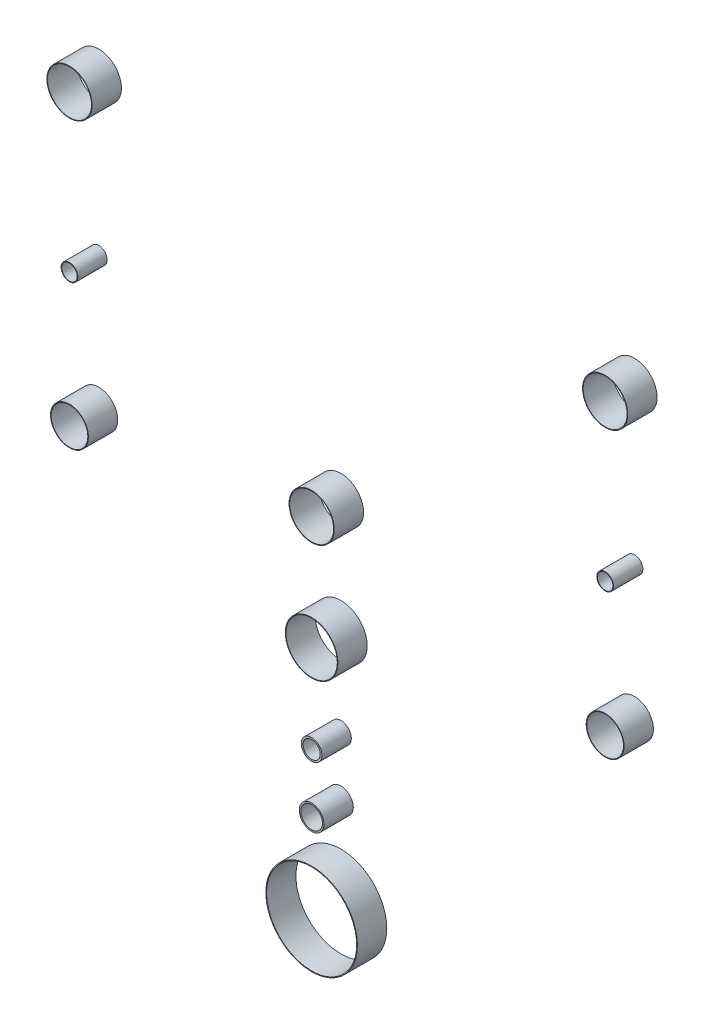
ISO-10303-21;
HEADER;
FILE_DESCRIPTION(('STEP AP214'),'2;1');
FILE_NAME('part.step','',(''),(''),'','','');
FILE_SCHEMA(('AUTOMOTIVE_DESIGN { 1 0 10303 214 1 1 1 1 }'));
ENDSEC;
DATA;
#1=APPLICATION_CONTEXT('core data for automotive mechanical design processes');
#2=APPLICATION_PROTOCOL_DEFINITION('international standard','automotive_design',2000,#1);
#3=PRODUCT_CONTEXT('',#1,'mechanical');
#4=PRODUCT('Part','Part','',(#3));
#5=PRODUCT_RELATED_PRODUCT_CATEGORY('part','',(#4));
#6=PRODUCT_DEFINITION_FORMATION('','',#4);
#7=PRODUCT_DEFINITION_CONTEXT('part definition',#1,'design');
#8=PRODUCT_DEFINITION('design','',#6,#7);
#9=PRODUCT_DEFINITION_SHAPE('','',#8);
#10=(LENGTH_UNIT() NAMED_UNIT(*) SI_UNIT(.MILLI.,.METRE.));
#11=(NAMED_UNIT(*) PLANE_ANGLE_UNIT() SI_UNIT($,.RADIAN.));
#12=(NAMED_UNIT(*) SI_UNIT($,.STERADIAN.) SOLID_ANGLE_UNIT());
#13=UNCERTAINTY_MEASURE_WITH_UNIT(LENGTH_MEASURE(1.E-05),#10,'distance_accuracy_value','');
#14=(GEOMETRIC_REPRESENTATION_CONTEXT(3) GLOBAL_UNCERTAINTY_ASSIGNED_CONTEXT((#13)) GLOBAL_UNIT_ASSIGNED_CONTEXT((#10,
#11,#12)) REPRESENTATION_CONTEXT('',''));
#15=CARTESIAN_POINT('',(0.,0.,0.));
#16=DIRECTION('',(0.,0.,1.));
#17=DIRECTION('',(1.,0.,0.));
#18=AXIS2_PLACEMENT_3D('',#15,#16,#17);
#19=CARTESIAN_POINT('',(-4400.,-14841.3262914129,200.000000000001));
#20=DIRECTION('',(0.,0.,1.));
#21=DIRECTION('',(1.,0.,0.));
#22=AXIS2_PLACEMENT_3D('',#19,#20,#21);
#23=PLANE('',#22);
#24=CARTESIAN_POINT('',(-4400.,-14841.3262914129,200.000000000001));
#25=DIRECTION('',(0.,0.,1.));
#26=DIRECTION('',(1.,0.,0.));
#27=AXIS2_PLACEMENT_3D('',#24,#25,#26);
#28=CIRCLE('',#27,129.000000000001);
#29=CARTESIAN_POINT('',(-4271.,-14841.3262914129,200.000000000001));
#30=VERTEX_POINT('',#29);
#31=EDGE_CURVE('E11',#30,#30,#28,.T.);
#32=ORIENTED_EDGE('',*,*,#31,.T.);
#33=EDGE_LOOP('',(#32));
#34=FACE_BOUND('',#33,.T.);
#35=CARTESIAN_POINT('',(-4400.,-14841.3262914129,200.000000000001));
#36=DIRECTION('',(0.,0.,1.));
#37=DIRECTION('',(1.,0.,0.));
#38=AXIS2_PLACEMENT_3D('',#35,#36,#37);
#39=CIRCLE('',#38,125.);
#40=CARTESIAN_POINT('',(-4275.,-14841.3262914129,200.000000000001));
#41=VERTEX_POINT('',#40);
#42=EDGE_CURVE('E48',#41,#41,#39,.T.);
#43=ORIENTED_EDGE('',*,*,#42,.F.);
#44=EDGE_LOOP('',(#43));
#45=FACE_BOUND('',#44,.T.);
#46=ADVANCED_FACE('F37',(#34,#45),#23,.T.);
#47=CARTESIAN_POINT('',(-4400.,-14841.3262914129,0.));
#48=DIRECTION('',(0.,0.,1.));
#49=DIRECTION('',(1.,0.,0.));
#50=AXIS2_PLACEMENT_3D('',#47,#48,#49);
#51=PLANE('',#50);
#52=CARTESIAN_POINT('',(-4400.,-14841.3262914129,0.));
#53=DIRECTION('',(0.,0.,1.));
#54=DIRECTION('',(1.,0.,0.));
#55=AXIS2_PLACEMENT_3D('',#52,#53,#54);
#56=CIRCLE('',#55,129.000000000001);
#57=CARTESIAN_POINT('',(-4271.,-14841.3262914129,0.));
#58=VERTEX_POINT('',#57);
#59=EDGE_CURVE('E41',#58,#58,#56,.T.);
#60=ORIENTED_EDGE('',*,*,#59,.F.);
#61=EDGE_LOOP('',(#60));
#62=FACE_BOUND('',#61,.T.);
#63=CARTESIAN_POINT('',(-4400.,-14841.3262914129,0.));
#64=DIRECTION('',(0.,0.,1.));
#65=DIRECTION('',(1.,0.,0.));
#66=AXIS2_PLACEMENT_3D('',#63,#64,#65);
#67=CIRCLE('',#66,125.);
#68=CARTESIAN_POINT('',(-4275.,-14841.3262914129,0.));
#69=VERTEX_POINT('',#68);
#70=EDGE_CURVE('E50',#69,#69,#67,.T.);
#71=ORIENTED_EDGE('',*,*,#70,.T.);
#72=EDGE_LOOP('',(#71));
#73=FACE_BOUND('',#72,.T.);
#74=ADVANCED_FACE('F60',(#62,#73),#51,.F.);
#75=CARTESIAN_POINT('',(-4400.,-14841.3262914129,200.000000000001));
#76=DIRECTION('',(0.,0.,-1.));
#77=DIRECTION('',(-1.,0.,0.));
#78=AXIS2_PLACEMENT_3D('',#75,#76,#77);
#79=CYLINDRICAL_SURFACE('',#78,129.000000000001);
#80=ORIENTED_EDGE('',*,*,#31,.F.);
#81=EDGE_LOOP('',(#80));
#82=FACE_BOUND('',#81,.T.);
#83=ORIENTED_EDGE('',*,*,#59,.T.);
#84=EDGE_LOOP('',(#83));
#85=FACE_BOUND('',#84,.T.);
#86=ADVANCED_FACE('F39',(#82,#85),#79,.T.);
#87=CARTESIAN_POINT('',(-4400.,-14841.3262914129,200.000000000001));
#88=DIRECTION('',(0.,0.,-1.));
#89=DIRECTION('',(-1.,0.,0.));
#90=AXIS2_PLACEMENT_3D('',#87,#88,#89);
#91=CYLINDRICAL_SURFACE('',#90,125.);
#92=ORIENTED_EDGE('',*,*,#42,.T.);
#93=EDGE_LOOP('',(#92));
#94=FACE_BOUND('',#93,.T.);
#95=ORIENTED_EDGE('',*,*,#70,.F.);
#96=EDGE_LOOP('',(#95));
#97=FACE_BOUND('',#96,.T.);
#98=ADVANCED_FACE('F56',(#94,#97),#91,.F.);
#99=CLOSED_SHELL('',(#46,#74,#86,#98));
#100=MANIFOLD_SOLID_BREP('B2',#99);
#101=CARTESIAN_POINT('',(-4400.,-13933.0511274458,200.000000000003));
#102=DIRECTION('',(0.,0.,1.));
#103=DIRECTION('',(1.,0.,0.));
#104=AXIS2_PLACEMENT_3D('',#101,#102,#103);
#105=PLANE('',#104);
#106=CARTESIAN_POINT('',(-4400.,-13933.0511274458,200.000000000003));
#107=DIRECTION('',(0.,0.,1.));
#108=DIRECTION('',(1.,0.,0.));
#109=AXIS2_PLACEMENT_3D('',#106,#107,#108);
#110=CIRCLE('',#109,57.0000000000002);
#111=CARTESIAN_POINT('',(-4343.,-13933.0511274458,200.000000000003));
#112=VERTEX_POINT('',#111);
#113=EDGE_CURVE('E36',#112,#112,#110,.T.);
#114=ORIENTED_EDGE('',*,*,#113,.T.);
#115=EDGE_LOOP('',(#114));
#116=FACE_BOUND('',#115,.T.);
#117=CARTESIAN_POINT('',(-4400.,-13933.0511274458,200.000000000003));
#118=DIRECTION('',(0.,0.,1.));
#119=DIRECTION('',(1.,0.,0.));
#120=AXIS2_PLACEMENT_3D('',#117,#118,#119);
#121=CIRCLE('',#120,52.9999999999999);
#122=CARTESIAN_POINT('',(-4347.,-13933.0511274458,200.000000000003));
#123=VERTEX_POINT('',#122);
#124=EDGE_CURVE('E117',#123,#123,#121,.T.);
#125=ORIENTED_EDGE('',*,*,#124,.F.);
#126=EDGE_LOOP('',(#125));
#127=FACE_BOUND('',#126,.T.);
#128=ADVANCED_FACE('F106',(#116,#127),#105,.T.);
#129=CARTESIAN_POINT('',(-4400.,-13933.0511274458,0.));
#130=DIRECTION('',(0.,0.,1.));
#131=DIRECTION('',(1.,0.,0.));
#132=AXIS2_PLACEMENT_3D('',#129,#130,#131);
#133=PLANE('',#132);
#134=CARTESIAN_POINT('',(-4400.,-13933.0511274458,0.));
#135=DIRECTION('',(0.,0.,1.));
#136=DIRECTION('',(1.,0.,0.));
#137=AXIS2_PLACEMENT_3D('',#134,#135,#136);
#138=CIRCLE('',#137,57.0000000000002);
#139=CARTESIAN_POINT('',(-4343.,-13933.0511274458,0.));
#140=VERTEX_POINT('',#139);
#141=EDGE_CURVE('E110',#140,#140,#138,.T.);
#142=ORIENTED_EDGE('',*,*,#141,.F.);
#143=EDGE_LOOP('',(#142));
#144=FACE_BOUND('',#143,.T.);
#145=CARTESIAN_POINT('',(-4400.,-13933.0511274458,0.));
#146=DIRECTION('',(0.,0.,1.));
#147=DIRECTION('',(1.,0.,0.));
#148=AXIS2_PLACEMENT_3D('',#145,#146,#147);
#149=CIRCLE('',#148,52.9999999999999);
#150=CARTESIAN_POINT('',(-4347.,-13933.0511274458,0.));
#151=VERTEX_POINT('',#150);
#152=EDGE_CURVE('E119',#151,#151,#149,.T.);
#153=ORIENTED_EDGE('',*,*,#152,.T.);
#154=EDGE_LOOP('',(#153));
#155=FACE_BOUND('',#154,.T.);
#156=ADVANCED_FACE('F129',(#144,#155),#133,.F.);
#157=CARTESIAN_POINT('',(-4400.,-13933.0511274458,200.000000000003));
#158=DIRECTION('',(0.,0.,-1.));
#159=DIRECTION('',(-1.,0.,0.));
#160=AXIS2_PLACEMENT_3D('',#157,#158,#159);
#161=CYLINDRICAL_SURFACE('',#160,57.0000000000002);
#162=ORIENTED_EDGE('',*,*,#113,.F.);
#163=EDGE_LOOP('',(#162));
#164=FACE_BOUND('',#163,.T.);
#165=ORIENTED_EDGE('',*,*,#141,.T.);
#166=EDGE_LOOP('',(#165));
#167=FACE_BOUND('',#166,.T.);
#168=ADVANCED_FACE('F108',(#164,#167),#161,.T.);
#169=CARTESIAN_POINT('',(-4400.,-13933.0511274458,200.000000000003));
#170=DIRECTION('',(0.,0.,-1.));
#171=DIRECTION('',(-1.,0.,0.));
#172=AXIS2_PLACEMENT_3D('',#169,#170,#171);
#173=CYLINDRICAL_SURFACE('',#172,52.9999999999999);
#174=ORIENTED_EDGE('',*,*,#124,.T.);
#175=EDGE_LOOP('',(#174));
#176=FACE_BOUND('',#175,.T.);
#177=ORIENTED_EDGE('',*,*,#152,.F.);
#178=EDGE_LOOP('',(#177));
#179=FACE_BOUND('',#178,.T.);
#180=ADVANCED_FACE('F125',(#176,#179),#173,.F.);
#181=CLOSED_SHELL('',(#128,#156,#168,#180));
#182=MANIFOLD_SOLID_BREP('B6',#181);
#183=CARTESIAN_POINT('',(-4400.,-12870.955169581,200.000000000003));
#184=DIRECTION('',(0.,0.,1.));
#185=DIRECTION('',(1.,0.,0.));
#186=AXIS2_PLACEMENT_3D('',#183,#184,#185);
#187=PLANE('',#186);
#188=CARTESIAN_POINT('',(-4400.,-12870.955169581,200.000000000003));
#189=DIRECTION('',(0.,0.,1.));
#190=DIRECTION('',(1.,0.,0.));
#191=AXIS2_PLACEMENT_3D('',#188,#189,#190);
#192=CIRCLE('',#191,154.);
#193=CARTESIAN_POINT('',(-4246.,-12870.955169581,200.000000000003));
#194=VERTEX_POINT('',#193);
#195=EDGE_CURVE('E105',#194,#194,#192,.T.);
#196=ORIENTED_EDGE('',*,*,#195,.T.);
#197=EDGE_LOOP('',(#196));
#198=FACE_BOUND('',#197,.T.);
#199=CARTESIAN_POINT('',(-4400.,-12870.955169581,200.000000000003));
#200=DIRECTION('',(0.,0.,1.));
#201=DIRECTION('',(1.,0.,0.));
#202=AXIS2_PLACEMENT_3D('',#199,#200,#201);
#203=CIRCLE('',#202,150.);
#204=CARTESIAN_POINT('',(-4250.,-12870.955169581,200.000000000003));
#205=VERTEX_POINT('',#204);
#206=EDGE_CURVE('E186',#205,#205,#203,.T.);
#207=ORIENTED_EDGE('',*,*,#206,.F.);
#208=EDGE_LOOP('',(#207));
#209=FACE_BOUND('',#208,.T.);
#210=ADVANCED_FACE('F175',(#198,#209),#187,.T.);
#211=CARTESIAN_POINT('',(-4400.,-12870.955169581,0.));
#212=DIRECTION('',(0.,0.,1.));
#213=DIRECTION('',(1.,0.,0.));
#214=AXIS2_PLACEMENT_3D('',#211,#212,#213);
#215=PLANE('',#214);
#216=CARTESIAN_POINT('',(-4400.,-12870.955169581,0.));
#217=DIRECTION('',(0.,0.,1.));
#218=DIRECTION('',(1.,0.,0.));
#219=AXIS2_PLACEMENT_3D('',#216,#217,#218);
#220=CIRCLE('',#219,154.);
#221=CARTESIAN_POINT('',(-4246.,-12870.955169581,0.));
#222=VERTEX_POINT('',#221);
#223=EDGE_CURVE('E179',#222,#222,#220,.T.);
#224=ORIENTED_EDGE('',*,*,#223,.F.);
#225=EDGE_LOOP('',(#224));
#226=FACE_BOUND('',#225,.T.);
#227=CARTESIAN_POINT('',(-4400.,-12870.955169581,0.));
#228=DIRECTION('',(0.,0.,1.));
#229=DIRECTION('',(1.,0.,0.));
#230=AXIS2_PLACEMENT_3D('',#227,#228,#229);
#231=CIRCLE('',#230,150.);
#232=CARTESIAN_POINT('',(-4250.,-12870.955169581,0.));
#233=VERTEX_POINT('',#232);
#234=EDGE_CURVE('E188',#233,#233,#231,.T.);
#235=ORIENTED_EDGE('',*,*,#234,.T.);
#236=EDGE_LOOP('',(#235));
#237=FACE_BOUND('',#236,.T.);
#238=ADVANCED_FACE('F198',(#226,#237),#215,.F.);
#239=CARTESIAN_POINT('',(-4400.,-12870.955169581,200.000000000003));
#240=DIRECTION('',(0.,0.,-1.));
#241=DIRECTION('',(-1.,0.,0.));
#242=AXIS2_PLACEMENT_3D('',#239,#240,#241);
#243=CYLINDRICAL_SURFACE('',#242,154.);
#244=ORIENTED_EDGE('',*,*,#195,.F.);
#245=EDGE_LOOP('',(#244));
#246=FACE_BOUND('',#245,.T.);
#247=ORIENTED_EDGE('',*,*,#223,.T.);
#248=EDGE_LOOP('',(#247));
#249=FACE_BOUND('',#248,.T.);
#250=ADVANCED_FACE('F177',(#246,#249),#243,.T.);
#251=CARTESIAN_POINT('',(-4400.,-12870.955169581,200.000000000003));
#252=DIRECTION('',(0.,0.,-1.));
#253=DIRECTION('',(-1.,0.,0.));
#254=AXIS2_PLACEMENT_3D('',#251,#252,#253);
#255=CYLINDRICAL_SURFACE('',#254,150.);
#256=ORIENTED_EDGE('',*,*,#206,.T.);
#257=EDGE_LOOP('',(#256));
#258=FACE_BOUND('',#257,.T.);
#259=ORIENTED_EDGE('',*,*,#234,.F.);
#260=EDGE_LOOP('',(#259));
#261=FACE_BOUND('',#260,.T.);
#262=ADVANCED_FACE('F194',(#258,#261),#255,.F.);
#263=CLOSED_SHELL('',(#210,#238,#250,#262));
#264=MANIFOLD_SOLID_BREP('B31',#263);
#265=CARTESIAN_POINT('',(-750.,-14841.3262914129,200.000000000001));
#266=DIRECTION('',(0.,0.,1.));
#267=DIRECTION('',(1.,0.,0.));
#268=AXIS2_PLACEMENT_3D('',#265,#266,#267);
#269=PLANE('',#268);
#270=CARTESIAN_POINT('',(-750.,-14841.3262914129,200.000000000001));
#271=DIRECTION('',(0.,0.,1.));
#272=DIRECTION('',(1.,0.,0.));
#273=AXIS2_PLACEMENT_3D('',#270,#271,#272);
#274=CIRCLE('',#273,129.);
#275=CARTESIAN_POINT('',(-621.,-14841.3262914129,200.000000000001));
#276=VERTEX_POINT('',#275);
#277=EDGE_CURVE('E174',#276,#276,#274,.T.);
#278=ORIENTED_EDGE('',*,*,#277,.T.);
#279=EDGE_LOOP('',(#278));
#280=FACE_BOUND('',#279,.T.);
#281=CARTESIAN_POINT('',(-750.,-14841.3262914129,200.000000000001));
#282=DIRECTION('',(0.,0.,1.));
#283=DIRECTION('',(1.,0.,0.));
#284=AXIS2_PLACEMENT_3D('',#281,#282,#283);
#285=CIRCLE('',#284,125.);
#286=CARTESIAN_POINT('',(-625.,-14841.3262914129,200.000000000001));
#287=VERTEX_POINT('',#286);
#288=EDGE_CURVE('E255',#287,#287,#285,.T.);
#289=ORIENTED_EDGE('',*,*,#288,.F.);
#290=EDGE_LOOP('',(#289));
#291=FACE_BOUND('',#290,.T.);
#292=ADVANCED_FACE('F244',(#280,#291),#269,.T.);
#293=CARTESIAN_POINT('',(-750.,-14841.3262914129,0.));
#294=DIRECTION('',(0.,0.,1.));
#295=DIRECTION('',(1.,0.,0.));
#296=AXIS2_PLACEMENT_3D('',#293,#294,#295);
#297=PLANE('',#296);
#298=CARTESIAN_POINT('',(-750.,-14841.3262914129,0.));
#299=DIRECTION('',(0.,0.,1.));
#300=DIRECTION('',(1.,0.,0.));
#301=AXIS2_PLACEMENT_3D('',#298,#299,#300);
#302=CIRCLE('',#301,129.);
#303=CARTESIAN_POINT('',(-621.,-14841.3262914129,0.));
#304=VERTEX_POINT('',#303);
#305=EDGE_CURVE('E248',#304,#304,#302,.T.);
#306=ORIENTED_EDGE('',*,*,#305,.F.);
#307=EDGE_LOOP('',(#306));
#308=FACE_BOUND('',#307,.T.);
#309=CARTESIAN_POINT('',(-750.,-14841.3262914129,0.));
#310=DIRECTION('',(0.,0.,1.));
#311=DIRECTION('',(1.,0.,0.));
#312=AXIS2_PLACEMENT_3D('',#309,#310,#311);
#313=CIRCLE('',#312,125.);
#314=CARTESIAN_POINT('',(-625.,-14841.3262914129,0.));
#315=VERTEX_POINT('',#314);
#316=EDGE_CURVE('E257',#315,#315,#313,.T.);
#317=ORIENTED_EDGE('',*,*,#316,.T.);
#318=EDGE_LOOP('',(#317));
#319=FACE_BOUND('',#318,.T.);
#320=ADVANCED_FACE('F267',(#308,#319),#297,.F.);
#321=CARTESIAN_POINT('',(-750.,-14841.3262914129,200.000000000001));
#322=DIRECTION('',(0.,0.,-1.));
#323=DIRECTION('',(-1.,0.,0.));
#324=AXIS2_PLACEMENT_3D('',#321,#322,#323);
#325=CYLINDRICAL_SURFACE('',#324,129.);
#326=ORIENTED_EDGE('',*,*,#277,.F.);
#327=EDGE_LOOP('',(#326));
#328=FACE_BOUND('',#327,.T.);
#329=ORIENTED_EDGE('',*,*,#305,.T.);
#330=EDGE_LOOP('',(#329));
#331=FACE_BOUND('',#330,.T.);
#332=ADVANCED_FACE('F246',(#328,#331),#325,.T.);
#333=CARTESIAN_POINT('',(-750.,-14841.3262914129,200.000000000001));
#334=DIRECTION('',(0.,0.,-1.));
#335=DIRECTION('',(-1.,0.,0.));
#336=AXIS2_PLACEMENT_3D('',#333,#334,#335);
#337=CYLINDRICAL_SURFACE('',#336,125.);
#338=ORIENTED_EDGE('',*,*,#288,.T.);
#339=EDGE_LOOP('',(#338));
#340=FACE_BOUND('',#339,.T.);
#341=ORIENTED_EDGE('',*,*,#316,.F.);
#342=EDGE_LOOP('',(#341));
#343=FACE_BOUND('',#342,.T.);
#344=ADVANCED_FACE('F263',(#340,#343),#337,.F.);
#345=CLOSED_SHELL('',(#292,#320,#332,#344));
#346=MANIFOLD_SOLID_BREP('B100',#345);
#347=CARTESIAN_POINT('',(-750.,-13933.0511274458,200.000000000001));
#348=DIRECTION('',(0.,0.,1.));
#349=DIRECTION('',(1.,0.,0.));
#350=AXIS2_PLACEMENT_3D('',#347,#348,#349);
#351=PLANE('',#350);
#352=CARTESIAN_POINT('',(-750.,-13933.0511274458,200.000000000001));
#353=DIRECTION('',(0.,0.,1.));
#354=DIRECTION('',(1.,0.,0.));
#355=AXIS2_PLACEMENT_3D('',#352,#353,#354);
#356=CIRCLE('',#355,56.9999999999998);
#357=CARTESIAN_POINT('',(-693.,-13933.0511274458,200.000000000001));
#358=VERTEX_POINT('',#357);
#359=EDGE_CURVE('E243',#358,#358,#356,.T.);
#360=ORIENTED_EDGE('',*,*,#359,.T.);
#361=EDGE_LOOP('',(#360));
#362=FACE_BOUND('',#361,.T.);
#363=CARTESIAN_POINT('',(-750.,-13933.0511274458,200.000000000001));
#364=DIRECTION('',(0.,0.,1.));
#365=DIRECTION('',(1.,0.,0.));
#366=AXIS2_PLACEMENT_3D('',#363,#364,#365);
#367=CIRCLE('',#366,52.9999999999997);
#368=CARTESIAN_POINT('',(-697.,-13933.0511274458,200.000000000001));
#369=VERTEX_POINT('',#368);
#370=EDGE_CURVE('E324',#369,#369,#367,.T.);
#371=ORIENTED_EDGE('',*,*,#370,.F.);
#372=EDGE_LOOP('',(#371));
#373=FACE_BOUND('',#372,.T.);
#374=ADVANCED_FACE('F313',(#362,#373),#351,.T.);
#375=CARTESIAN_POINT('',(-750.,-13933.0511274458,0.));
#376=DIRECTION('',(0.,0.,1.));
#377=DIRECTION('',(1.,0.,0.));
#378=AXIS2_PLACEMENT_3D('',#375,#376,#377);
#379=PLANE('',#378);
#380=CARTESIAN_POINT('',(-750.,-13933.0511274458,0.));
#381=DIRECTION('',(0.,0.,1.));
#382=DIRECTION('',(1.,0.,0.));
#383=AXIS2_PLACEMENT_3D('',#380,#381,#382);
#384=CIRCLE('',#383,56.9999999999998);
#385=CARTESIAN_POINT('',(-693.,-13933.0511274458,0.));
#386=VERTEX_POINT('',#385);
#387=EDGE_CURVE('E317',#386,#386,#384,.T.);
#388=ORIENTED_EDGE('',*,*,#387,.F.);
#389=EDGE_LOOP('',(#388));
#390=FACE_BOUND('',#389,.T.);
#391=CARTESIAN_POINT('',(-750.,-13933.0511274458,0.));
#392=DIRECTION('',(0.,0.,1.));
#393=DIRECTION('',(1.,0.,0.));
#394=AXIS2_PLACEMENT_3D('',#391,#392,#393);
#395=CIRCLE('',#394,52.9999999999997);
#396=CARTESIAN_POINT('',(-697.,-13933.0511274458,0.));
#397=VERTEX_POINT('',#396);
#398=EDGE_CURVE('E326',#397,#397,#395,.T.);
#399=ORIENTED_EDGE('',*,*,#398,.T.);
#400=EDGE_LOOP('',(#399));
#401=FACE_BOUND('',#400,.T.);
#402=ADVANCED_FACE('F336',(#390,#401),#379,.F.);
#403=CARTESIAN_POINT('',(-750.,-13933.0511274458,200.000000000001));
#404=DIRECTION('',(0.,0.,-1.));
#405=DIRECTION('',(-1.,0.,0.));
#406=AXIS2_PLACEMENT_3D('',#403,#404,#405);
#407=CYLINDRICAL_SURFACE('',#406,56.9999999999998);
#408=ORIENTED_EDGE('',*,*,#359,.F.);
#409=EDGE_LOOP('',(#408));
#410=FACE_BOUND('',#409,.T.);
#411=ORIENTED_EDGE('',*,*,#387,.T.);
#412=EDGE_LOOP('',(#411));
#413=FACE_BOUND('',#412,.T.);
#414=ADVANCED_FACE('F315',(#410,#413),#407,.T.);
#415=CARTESIAN_POINT('',(-750.,-13933.0511274458,200.000000000001));
#416=DIRECTION('',(0.,0.,-1.));
#417=DIRECTION('',(-1.,0.,0.));
#418=AXIS2_PLACEMENT_3D('',#415,#416,#417);
#419=CYLINDRICAL_SURFACE('',#418,52.9999999999997);
#420=ORIENTED_EDGE('',*,*,#370,.T.);
#421=EDGE_LOOP('',(#420));
#422=FACE_BOUND('',#421,.T.);
#423=ORIENTED_EDGE('',*,*,#398,.F.);
#424=EDGE_LOOP('',(#423));
#425=FACE_BOUND('',#424,.T.);
#426=ADVANCED_FACE('F332',(#422,#425),#419,.F.);
#427=CLOSED_SHELL('',(#374,#402,#414,#426));
#428=MANIFOLD_SOLID_BREP('B169',#427);
#429=CARTESIAN_POINT('',(-750.,-12870.955169581,200.000000000003));
#430=DIRECTION('',(0.,0.,1.));
#431=DIRECTION('',(1.,0.,0.));
#432=AXIS2_PLACEMENT_3D('',#429,#430,#431);
#433=PLANE('',#432);
#434=CARTESIAN_POINT('',(-750.,-12870.955169581,200.000000000003));
#435=DIRECTION('',(0.,0.,1.));
#436=DIRECTION('',(1.,0.,0.));
#437=AXIS2_PLACEMENT_3D('',#434,#435,#436);
#438=CIRCLE('',#437,154.);
#439=CARTESIAN_POINT('',(-596.,-12870.955169581,200.000000000003));
#440=VERTEX_POINT('',#439);
#441=EDGE_CURVE('E312',#440,#440,#438,.T.);
#442=ORIENTED_EDGE('',*,*,#441,.T.);
#443=EDGE_LOOP('',(#442));
#444=FACE_BOUND('',#443,.T.);
#445=CARTESIAN_POINT('',(-750.,-12870.955169581,200.000000000003));
#446=DIRECTION('',(0.,0.,1.));
#447=DIRECTION('',(1.,0.,0.));
#448=AXIS2_PLACEMENT_3D('',#445,#446,#447);
#449=CIRCLE('',#448,150.);
#450=CARTESIAN_POINT('',(-600.,-12870.955169581,200.000000000003));
#451=VERTEX_POINT('',#450);
#452=EDGE_CURVE('E393',#451,#451,#449,.T.);
#453=ORIENTED_EDGE('',*,*,#452,.F.);
#454=EDGE_LOOP('',(#453));
#455=FACE_BOUND('',#454,.T.);
#456=ADVANCED_FACE('F382',(#444,#455),#433,.T.);
#457=CARTESIAN_POINT('',(-750.,-12870.955169581,0.));
#458=DIRECTION('',(0.,0.,1.));
#459=DIRECTION('',(1.,0.,0.));
#460=AXIS2_PLACEMENT_3D('',#457,#458,#459);
#461=PLANE('',#460);
#462=CARTESIAN_POINT('',(-750.,-12870.955169581,0.));
#463=DIRECTION('',(0.,0.,1.));
#464=DIRECTION('',(1.,0.,0.));
#465=AXIS2_PLACEMENT_3D('',#462,#463,#464);
#466=CIRCLE('',#465,154.);
#467=CARTESIAN_POINT('',(-596.,-12870.955169581,0.));
#468=VERTEX_POINT('',#467);
#469=EDGE_CURVE('E386',#468,#468,#466,.T.);
#470=ORIENTED_EDGE('',*,*,#469,.F.);
#471=EDGE_LOOP('',(#470));
#472=FACE_BOUND('',#471,.T.);
#473=CARTESIAN_POINT('',(-750.,-12870.955169581,0.));
#474=DIRECTION('',(0.,0.,1.));
#475=DIRECTION('',(1.,0.,0.));
#476=AXIS2_PLACEMENT_3D('',#473,#474,#475);
#477=CIRCLE('',#476,150.);
#478=CARTESIAN_POINT('',(-600.,-12870.955169581,0.));
#479=VERTEX_POINT('',#478);
#480=EDGE_CURVE('E395',#479,#479,#477,.T.);
#481=ORIENTED_EDGE('',*,*,#480,.T.);
#482=EDGE_LOOP('',(#481));
#483=FACE_BOUND('',#482,.T.);
#484=ADVANCED_FACE('F405',(#472,#483),#461,.F.);
#485=CARTESIAN_POINT('',(-750.,-12870.955169581,200.000000000003));
#486=DIRECTION('',(0.,0.,-1.));
#487=DIRECTION('',(-1.,0.,0.));
#488=AXIS2_PLACEMENT_3D('',#485,#486,#487);
#489=CYLINDRICAL_SURFACE('',#488,154.);
#490=ORIENTED_EDGE('',*,*,#441,.F.);
#491=EDGE_LOOP('',(#490));
#492=FACE_BOUND('',#491,.T.);
#493=ORIENTED_EDGE('',*,*,#469,.T.);
#494=EDGE_LOOP('',(#493));
#495=FACE_BOUND('',#494,.T.);
#496=ADVANCED_FACE('F384',(#492,#495),#489,.T.);
#497=CARTESIAN_POINT('',(-750.,-12870.955169581,200.000000000003));
#498=DIRECTION('',(0.,0.,-1.));
#499=DIRECTION('',(-1.,0.,0.));
#500=AXIS2_PLACEMENT_3D('',#497,#498,#499);
#501=CYLINDRICAL_SURFACE('',#500,150.);
#502=ORIENTED_EDGE('',*,*,#452,.T.);
#503=EDGE_LOOP('',(#502));
#504=FACE_BOUND('',#503,.T.);
#505=ORIENTED_EDGE('',*,*,#480,.F.);
#506=EDGE_LOOP('',(#505));
#507=FACE_BOUND('',#506,.T.);
#508=ADVANCED_FACE('F401',(#504,#507),#501,.F.);
#509=CLOSED_SHELL('',(#456,#484,#496,#508));
#510=MANIFOLD_SOLID_BREP('B238',#509);
#511=CARTESIAN_POINT('',(-2750.,-14550.,200.000000000001));
#512=DIRECTION('',(0.,0.,1.));
#513=DIRECTION('',(1.,0.,0.));
#514=AXIS2_PLACEMENT_3D('',#511,#512,#513);
#515=PLANE('',#514);
#516=CARTESIAN_POINT('',(-2750.,-14550.,200.000000000001));
#517=DIRECTION('',(0.,0.,1.));
#518=DIRECTION('',(1.,0.,0.));
#519=AXIS2_PLACEMENT_3D('',#516,#517,#518);
#520=CIRCLE('',#519,154.);
#521=CARTESIAN_POINT('',(-2596.,-14550.,200.000000000001));
#522=VERTEX_POINT('',#521);
#523=EDGE_CURVE('E381',#522,#522,#520,.T.);
#524=ORIENTED_EDGE('',*,*,#523,.T.);
#525=EDGE_LOOP('',(#524));
#526=FACE_BOUND('',#525,.T.);
#527=CARTESIAN_POINT('',(-2750.,-14550.,200.000000000001));
#528=DIRECTION('',(0.,0.,1.));
#529=DIRECTION('',(1.,0.,0.));
#530=AXIS2_PLACEMENT_3D('',#527,#528,#529);
#531=CIRCLE('',#530,150.);
#532=CARTESIAN_POINT('',(-2600.,-14550.,200.000000000001));
#533=VERTEX_POINT('',#532);
#534=EDGE_CURVE('E462',#533,#533,#531,.T.);
#535=ORIENTED_EDGE('',*,*,#534,.F.);
#536=EDGE_LOOP('',(#535));
#537=FACE_BOUND('',#536,.T.);
#538=ADVANCED_FACE('F451',(#526,#537),#515,.T.);
#539=CARTESIAN_POINT('',(-2750.,-14550.,0.));
#540=DIRECTION('',(0.,0.,1.));
#541=DIRECTION('',(1.,0.,0.));
#542=AXIS2_PLACEMENT_3D('',#539,#540,#541);
#543=PLANE('',#542);
#544=CARTESIAN_POINT('',(-2750.,-14550.,0.));
#545=DIRECTION('',(0.,0.,1.));
#546=DIRECTION('',(1.,0.,0.));
#547=AXIS2_PLACEMENT_3D('',#544,#545,#546);
#548=CIRCLE('',#547,154.);
#549=CARTESIAN_POINT('',(-2596.,-14550.,0.));
#550=VERTEX_POINT('',#549);
#551=EDGE_CURVE('E455',#550,#550,#548,.T.);
#552=ORIENTED_EDGE('',*,*,#551,.F.);
#553=EDGE_LOOP('',(#552));
#554=FACE_BOUND('',#553,.T.);
#555=CARTESIAN_POINT('',(-2750.,-14550.,0.));
#556=DIRECTION('',(0.,0.,1.));
#557=DIRECTION('',(1.,0.,0.));
#558=AXIS2_PLACEMENT_3D('',#555,#556,#557);
#559=CIRCLE('',#558,150.);
#560=CARTESIAN_POINT('',(-2600.,-14550.,0.));
#561=VERTEX_POINT('',#560);
#562=EDGE_CURVE('E464',#561,#561,#559,.T.);
#563=ORIENTED_EDGE('',*,*,#562,.T.);
#564=EDGE_LOOP('',(#563));
#565=FACE_BOUND('',#564,.T.);
#566=ADVANCED_FACE('F474',(#554,#565),#543,.F.);
#567=CARTESIAN_POINT('',(-2750.,-14550.,200.000000000001));
#568=DIRECTION('',(0.,0.,-1.));
#569=DIRECTION('',(-1.,0.,0.));
#570=AXIS2_PLACEMENT_3D('',#567,#568,#569);
#571=CYLINDRICAL_SURFACE('',#570,154.);
#572=ORIENTED_EDGE('',*,*,#523,.F.);
#573=EDGE_LOOP('',(#572));
#574=FACE_BOUND('',#573,.T.);
#575=ORIENTED_EDGE('',*,*,#551,.T.);
#576=EDGE_LOOP('',(#575));
#577=FACE_BOUND('',#576,.T.);
#578=ADVANCED_FACE('F453',(#574,#577),#571,.T.);
#579=CARTESIAN_POINT('',(-2750.,-14550.,200.000000000001));
#580=DIRECTION('',(0.,0.,-1.));
#581=DIRECTION('',(-1.,0.,0.));
#582=AXIS2_PLACEMENT_3D('',#579,#580,#581);
#583=CYLINDRICAL_SURFACE('',#582,150.);
#584=ORIENTED_EDGE('',*,*,#534,.T.);
#585=EDGE_LOOP('',(#584));
#586=FACE_BOUND('',#585,.T.);
#587=ORIENTED_EDGE('',*,*,#562,.F.);
#588=EDGE_LOOP('',(#587));
#589=FACE_BOUND('',#588,.T.);
#590=ADVANCED_FACE('F470',(#586,#589),#583,.F.);
#591=CLOSED_SHELL('',(#538,#566,#578,#590));
#592=MANIFOLD_SOLID_BREP('B307',#591);
#593=CARTESIAN_POINT('',(-2750.,-15325.,200.000000000001));
#594=DIRECTION('',(0.,0.,1.));
#595=DIRECTION('',(1.,0.,0.));
#596=AXIS2_PLACEMENT_3D('',#593,#594,#595);
#597=PLANE('',#596);
#598=CARTESIAN_POINT('',(-2750.,-15325.,200.000000000001));
#599=DIRECTION('',(0.,0.,1.));
#600=DIRECTION('',(1.,0.,0.));
#601=AXIS2_PLACEMENT_3D('',#598,#599,#600);
#602=CIRCLE('',#601,179.);
#603=CARTESIAN_POINT('',(-2571.,-15325.,200.000000000001));
#604=VERTEX_POINT('',#603);
#605=EDGE_CURVE('E450',#604,#604,#602,.T.);
#606=ORIENTED_EDGE('',*,*,#605,.T.);
#607=EDGE_LOOP('',(#606));
#608=FACE_BOUND('',#607,.T.);
#609=CARTESIAN_POINT('',(-2750.,-15325.,200.000000000001));
#610=DIRECTION('',(0.,0.,1.));
#611=DIRECTION('',(1.,0.,0.));
#612=AXIS2_PLACEMENT_3D('',#609,#610,#611);
#613=CIRCLE('',#612,175.);
#614=CARTESIAN_POINT('',(-2575.,-15325.,200.000000000001));
#615=VERTEX_POINT('',#614);
#616=EDGE_CURVE('E531',#615,#615,#613,.T.);
#617=ORIENTED_EDGE('',*,*,#616,.F.);
#618=EDGE_LOOP('',(#617));
#619=FACE_BOUND('',#618,.T.);
#620=ADVANCED_FACE('F520',(#608,#619),#597,.T.);
#621=CARTESIAN_POINT('',(-2750.,-15325.,0.));
#622=DIRECTION('',(0.,0.,1.));
#623=DIRECTION('',(1.,0.,0.));
#624=AXIS2_PLACEMENT_3D('',#621,#622,#623);
#625=PLANE('',#624);
#626=CARTESIAN_POINT('',(-2750.,-15325.,0.));
#627=DIRECTION('',(0.,0.,1.));
#628=DIRECTION('',(1.,0.,0.));
#629=AXIS2_PLACEMENT_3D('',#626,#627,#628);
#630=CIRCLE('',#629,179.);
#631=CARTESIAN_POINT('',(-2571.,-15325.,0.));
#632=VERTEX_POINT('',#631);
#633=EDGE_CURVE('E524',#632,#632,#630,.T.);
#634=ORIENTED_EDGE('',*,*,#633,.F.);
#635=EDGE_LOOP('',(#634));
#636=FACE_BOUND('',#635,.T.);
#637=CARTESIAN_POINT('',(-2750.,-15325.,0.));
#638=DIRECTION('',(0.,0.,1.));
#639=DIRECTION('',(1.,0.,0.));
#640=AXIS2_PLACEMENT_3D('',#637,#638,#639);
#641=CIRCLE('',#640,175.);
#642=CARTESIAN_POINT('',(-2575.,-15325.,0.));
#643=VERTEX_POINT('',#642);
#644=EDGE_CURVE('E533',#643,#643,#641,.T.);
#645=ORIENTED_EDGE('',*,*,#644,.T.);
#646=EDGE_LOOP('',(#645));
#647=FACE_BOUND('',#646,.T.);
#648=ADVANCED_FACE('F543',(#636,#647),#625,.F.);
#649=CARTESIAN_POINT('',(-2750.,-15325.,200.000000000001));
#650=DIRECTION('',(0.,0.,-1.));
#651=DIRECTION('',(-1.,0.,0.));
#652=AXIS2_PLACEMENT_3D('',#649,#650,#651);
#653=CYLINDRICAL_SURFACE('',#652,179.);
#654=ORIENTED_EDGE('',*,*,#605,.F.);
#655=EDGE_LOOP('',(#654));
#656=FACE_BOUND('',#655,.T.);
#657=ORIENTED_EDGE('',*,*,#633,.T.);
#658=EDGE_LOOP('',(#657));
#659=FACE_BOUND('',#658,.T.);
#660=ADVANCED_FACE('F522',(#656,#659),#653,.T.);
#661=CARTESIAN_POINT('',(-2750.,-15325.,200.000000000001));
#662=DIRECTION('',(0.,0.,-1.));
#663=DIRECTION('',(-1.,0.,0.));
#664=AXIS2_PLACEMENT_3D('',#661,#662,#663);
#665=CYLINDRICAL_SURFACE('',#664,175.);
#666=ORIENTED_EDGE('',*,*,#616,.T.);
#667=EDGE_LOOP('',(#666));
#668=FACE_BOUND('',#667,.T.);
#669=ORIENTED_EDGE('',*,*,#644,.F.);
#670=EDGE_LOOP('',(#669));
#671=FACE_BOUND('',#670,.T.);
#672=ADVANCED_FACE('F539',(#668,#671),#665,.F.);
#673=CLOSED_SHELL('',(#620,#648,#660,#672));
#674=MANIFOLD_SOLID_BREP('B376',#673);
#675=CARTESIAN_POINT('',(-2750.,-15925.,200.000000000003));
#676=DIRECTION('',(0.,0.,1.));
#677=DIRECTION('',(1.,0.,0.));
#678=AXIS2_PLACEMENT_3D('',#675,#676,#677);
#679=PLANE('',#678);
#680=CARTESIAN_POINT('',(-2750.,-15925.,200.000000000003));
#681=DIRECTION('',(0.,0.,1.));
#682=DIRECTION('',(1.,0.,0.));
#683=AXIS2_PLACEMENT_3D('',#680,#681,#682);
#684=CIRCLE('',#683,70.5000000000003);
#685=CARTESIAN_POINT('',(-2679.5,-15925.,200.000000000003));
#686=VERTEX_POINT('',#685);
#687=EDGE_CURVE('E519',#686,#686,#684,.T.);
#688=ORIENTED_EDGE('',*,*,#687,.T.);
#689=EDGE_LOOP('',(#688));
#690=FACE_BOUND('',#689,.T.);
#691=CARTESIAN_POINT('',(-2750.,-15925.,200.000000000003));
#692=DIRECTION('',(0.,0.,1.));
#693=DIRECTION('',(1.,0.,0.));
#694=AXIS2_PLACEMENT_3D('',#691,#692,#693);
#695=CIRCLE('',#694,58.4999999999998);
#696=CARTESIAN_POINT('',(-2691.5,-15925.,200.000000000003));
#697=VERTEX_POINT('',#696);
#698=EDGE_CURVE('E600',#697,#697,#695,.T.);
#699=ORIENTED_EDGE('',*,*,#698,.F.);
#700=EDGE_LOOP('',(#699));
#701=FACE_BOUND('',#700,.T.);
#702=ADVANCED_FACE('F589',(#690,#701),#679,.T.);
#703=CARTESIAN_POINT('',(-2750.,-15925.,0.));
#704=DIRECTION('',(0.,0.,1.));
#705=DIRECTION('',(1.,0.,0.));
#706=AXIS2_PLACEMENT_3D('',#703,#704,#705);
#707=PLANE('',#706);
#708=CARTESIAN_POINT('',(-2750.,-15925.,0.));
#709=DIRECTION('',(0.,0.,1.));
#710=DIRECTION('',(1.,0.,0.));
#711=AXIS2_PLACEMENT_3D('',#708,#709,#710);
#712=CIRCLE('',#711,70.5000000000003);
#713=CARTESIAN_POINT('',(-2679.5,-15925.,0.));
#714=VERTEX_POINT('',#713);
#715=EDGE_CURVE('E593',#714,#714,#712,.T.);
#716=ORIENTED_EDGE('',*,*,#715,.F.);
#717=EDGE_LOOP('',(#716));
#718=FACE_BOUND('',#717,.T.);
#719=CARTESIAN_POINT('',(-2750.,-15925.,0.));
#720=DIRECTION('',(0.,0.,1.));
#721=DIRECTION('',(1.,0.,0.));
#722=AXIS2_PLACEMENT_3D('',#719,#720,#721);
#723=CIRCLE('',#722,58.4999999999998);
#724=CARTESIAN_POINT('',(-2691.5,-15925.,0.));
#725=VERTEX_POINT('',#724);
#726=EDGE_CURVE('E602',#725,#725,#723,.T.);
#727=ORIENTED_EDGE('',*,*,#726,.T.);
#728=EDGE_LOOP('',(#727));
#729=FACE_BOUND('',#728,.T.);
#730=ADVANCED_FACE('F612',(#718,#729),#707,.F.);
#731=CARTESIAN_POINT('',(-2750.,-15925.,200.000000000003));
#732=DIRECTION('',(0.,0.,-1.));
#733=DIRECTION('',(-1.,0.,0.));
#734=AXIS2_PLACEMENT_3D('',#731,#732,#733);
#735=CYLINDRICAL_SURFACE('',#734,70.5000000000003);
#736=ORIENTED_EDGE('',*,*,#687,.F.);
#737=EDGE_LOOP('',(#736));
#738=FACE_BOUND('',#737,.T.);
#739=ORIENTED_EDGE('',*,*,#715,.T.);
#740=EDGE_LOOP('',(#739));
#741=FACE_BOUND('',#740,.T.);
#742=ADVANCED_FACE('F591',(#738,#741),#735,.T.);
#743=CARTESIAN_POINT('',(-2750.,-15925.,200.000000000003));
#744=DIRECTION('',(0.,0.,-1.));
#745=DIRECTION('',(-1.,0.,0.));
#746=AXIS2_PLACEMENT_3D('',#743,#744,#745);
#747=CYLINDRICAL_SURFACE('',#746,58.4999999999998);
#748=ORIENTED_EDGE('',*,*,#698,.T.);
#749=EDGE_LOOP('',(#748));
#750=FACE_BOUND('',#749,.T.);
#751=ORIENTED_EDGE('',*,*,#726,.F.);
#752=EDGE_LOOP('',(#751));
#753=FACE_BOUND('',#752,.T.);
#754=ADVANCED_FACE('F608',(#750,#753),#747,.F.);
#755=CLOSED_SHELL('',(#702,#730,#742,#754));
#756=MANIFOLD_SOLID_BREP('B445',#755);
#757=CARTESIAN_POINT('',(-2750.,-16325.,200.000000000003));
#758=DIRECTION('',(0.,0.,1.));
#759=DIRECTION('',(1.,0.,0.));
#760=AXIS2_PLACEMENT_3D('',#757,#758,#759);
#761=PLANE('',#760);
#762=CARTESIAN_POINT('',(-2750.,-16325.,200.000000000003));
#763=DIRECTION('',(0.,0.,1.));
#764=DIRECTION('',(1.,0.,0.));
#765=AXIS2_PLACEMENT_3D('',#762,#763,#764);
#766=CIRCLE('',#765,84.0000000000008);
#767=CARTESIAN_POINT('',(-2666.,-16325.,200.000000000003));
#768=VERTEX_POINT('',#767);
#769=EDGE_CURVE('E588',#768,#768,#766,.T.);
#770=ORIENTED_EDGE('',*,*,#769,.T.);
#771=EDGE_LOOP('',(#770));
#772=FACE_BOUND('',#771,.T.);
#773=CARTESIAN_POINT('',(-2750.,-16325.,200.000000000003));
#774=DIRECTION('',(0.,0.,1.));
#775=DIRECTION('',(1.,0.,0.));
#776=AXIS2_PLACEMENT_3D('',#773,#774,#775);
#777=CIRCLE('',#776,74.000000000001);
#778=CARTESIAN_POINT('',(-2676.,-16325.,200.000000000003));
#779=VERTEX_POINT('',#778);
#780=EDGE_CURVE('E668',#779,#779,#777,.T.);
#781=ORIENTED_EDGE('',*,*,#780,.F.);
#782=EDGE_LOOP('',(#781));
#783=FACE_BOUND('',#782,.T.);
#784=ADVANCED_FACE('F657',(#772,#783),#761,.T.);
#785=CARTESIAN_POINT('',(-2750.,-16325.,0.));
#786=DIRECTION('',(0.,0.,1.));
#787=DIRECTION('',(1.,0.,0.));
#788=AXIS2_PLACEMENT_3D('',#785,#786,#787);
#789=PLANE('',#788);
#790=CARTESIAN_POINT('',(-2750.,-16325.,0.));
#791=DIRECTION('',(0.,0.,1.));
#792=DIRECTION('',(1.,0.,0.));
#793=AXIS2_PLACEMENT_3D('',#790,#791,#792);
#794=CIRCLE('',#793,84.0000000000008);
#795=CARTESIAN_POINT('',(-2666.,-16325.,0.));
#796=VERTEX_POINT('',#795);
#797=EDGE_CURVE('E661',#796,#796,#794,.T.);
#798=ORIENTED_EDGE('',*,*,#797,.F.);
#799=EDGE_LOOP('',(#798));
#800=FACE_BOUND('',#799,.T.);
#801=CARTESIAN_POINT('',(-2750.,-16325.,0.));
#802=DIRECTION('',(0.,0.,1.));
#803=DIRECTION('',(1.,0.,0.));
#804=AXIS2_PLACEMENT_3D('',#801,#802,#803);
#805=CIRCLE('',#804,74.000000000001);
#806=CARTESIAN_POINT('',(-2676.,-16325.,0.));
#807=VERTEX_POINT('',#806);
#808=EDGE_CURVE('E670',#807,#807,#805,.T.);
#809=ORIENTED_EDGE('',*,*,#808,.T.);
#810=EDGE_LOOP('',(#809));
#811=FACE_BOUND('',#810,.T.);
#812=ADVANCED_FACE('F680',(#800,#811),#789,.F.);
#813=CARTESIAN_POINT('',(-2750.,-16325.,200.000000000003));
#814=DIRECTION('',(0.,0.,-1.));
#815=DIRECTION('',(-1.,0.,0.));
#816=AXIS2_PLACEMENT_3D('',#813,#814,#815);
#817=CYLINDRICAL_SURFACE('',#816,84.0000000000008);
#818=ORIENTED_EDGE('',*,*,#769,.F.);
#819=EDGE_LOOP('',(#818));
#820=FACE_BOUND('',#819,.T.);
#821=ORIENTED_EDGE('',*,*,#797,.T.);
#822=EDGE_LOOP('',(#821));
#823=FACE_BOUND('',#822,.T.);
#824=ADVANCED_FACE('F659',(#820,#823),#817,.T.);
#825=CARTESIAN_POINT('',(-2750.,-16325.,200.000000000003));
#826=DIRECTION('',(0.,0.,-1.));
#827=DIRECTION('',(-1.,0.,0.));
#828=AXIS2_PLACEMENT_3D('',#825,#826,#827);
#829=CYLINDRICAL_SURFACE('',#828,74.000000000001);
#830=ORIENTED_EDGE('',*,*,#780,.T.);
#831=EDGE_LOOP('',(#830));
#832=FACE_BOUND('',#831,.T.);
#833=ORIENTED_EDGE('',*,*,#808,.F.);
#834=EDGE_LOOP('',(#833));
#835=FACE_BOUND('',#834,.T.);
#836=ADVANCED_FACE('F676',(#832,#835),#829,.F.);
#837=CLOSED_SHELL('',(#784,#812,#824,#836));
#838=MANIFOLD_SOLID_BREP('B514',#837);
#839=CARTESIAN_POINT('',(-2750.,-16925.,200.000000000003));
#840=DIRECTION('',(0.,0.,1.));
#841=DIRECTION('',(1.,0.,0.));
#842=AXIS2_PLACEMENT_3D('',#839,#840,#841);
#843=PLANE('',#842);
#844=CARTESIAN_POINT('',(-2750.,-16925.,200.000000000003));
#845=DIRECTION('',(0.,0.,1.));
#846=DIRECTION('',(1.,0.,0.));
#847=AXIS2_PLACEMENT_3D('',#844,#845,#846);
#848=CIRCLE('',#847,311.999999999999);
#849=CARTESIAN_POINT('',(-2438.,-16925.,200.000000000003));
#850=VERTEX_POINT('',#849);
#851=EDGE_CURVE('E656',#850,#850,#848,.T.);
#852=ORIENTED_EDGE('',*,*,#851,.T.);
#853=EDGE_LOOP('',(#852));
#854=FACE_BOUND('',#853,.T.);
#855=CARTESIAN_POINT('',(-2750.,-16925.,200.000000000003));
#856=DIRECTION('',(0.,0.,1.));
#857=DIRECTION('',(1.,0.,0.));
#858=AXIS2_PLACEMENT_3D('',#855,#856,#857);
#859=CIRCLE('',#858,307.);
#860=CARTESIAN_POINT('',(-2443.,-16925.,200.000000000003));
#861=VERTEX_POINT('',#860);
#862=EDGE_CURVE('E729',#861,#861,#859,.T.);
#863=ORIENTED_EDGE('',*,*,#862,.F.);
#864=EDGE_LOOP('',(#863));
#865=FACE_BOUND('',#864,.T.);
#866=ADVANCED_FACE('F718',(#854,#865),#843,.T.);
#867=CARTESIAN_POINT('',(-2750.,-16925.,0.));
#868=DIRECTION('',(0.,0.,1.));
#869=DIRECTION('',(1.,0.,0.));
#870=AXIS2_PLACEMENT_3D('',#867,#868,#869);
#871=PLANE('',#870);
#872=CARTESIAN_POINT('',(-2750.,-16925.,0.));
#873=DIRECTION('',(0.,0.,1.));
#874=DIRECTION('',(1.,0.,0.));
#875=AXIS2_PLACEMENT_3D('',#872,#873,#874);
#876=CIRCLE('',#875,311.999999999999);
#877=CARTESIAN_POINT('',(-2438.,-16925.,0.));
#878=VERTEX_POINT('',#877);
#879=EDGE_CURVE('E722',#878,#878,#876,.T.);
#880=ORIENTED_EDGE('',*,*,#879,.F.);
#881=EDGE_LOOP('',(#880));
#882=FACE_BOUND('',#881,.T.);
#883=CARTESIAN_POINT('',(-2750.,-16925.,0.));
#884=DIRECTION('',(0.,0.,1.));
#885=DIRECTION('',(1.,0.,0.));
#886=AXIS2_PLACEMENT_3D('',#883,#884,#885);
#887=CIRCLE('',#886,307.);
#888=CARTESIAN_POINT('',(-2443.,-16925.,0.));
#889=VERTEX_POINT('',#888);
#890=EDGE_CURVE('E731',#889,#889,#887,.T.);
#891=ORIENTED_EDGE('',*,*,#890,.T.);
#892=EDGE_LOOP('',(#891));
#893=FACE_BOUND('',#892,.T.);
#894=ADVANCED_FACE('F741',(#882,#893),#871,.F.);
#895=CARTESIAN_POINT('',(-2750.,-16925.,200.000000000003));
#896=DIRECTION('',(0.,0.,-1.));
#897=DIRECTION('',(-1.,0.,0.));
#898=AXIS2_PLACEMENT_3D('',#895,#896,#897);
#899=CYLINDRICAL_SURFACE('',#898,311.999999999999);
#900=ORIENTED_EDGE('',*,*,#851,.F.);
#901=EDGE_LOOP('',(#900));
#902=FACE_BOUND('',#901,.T.);
#903=ORIENTED_EDGE('',*,*,#879,.T.);
#904=EDGE_LOOP('',(#903));
#905=FACE_BOUND('',#904,.T.);
#906=ADVANCED_FACE('F720',(#902,#905),#899,.T.);
#907=CARTESIAN_POINT('',(-2750.,-16925.,200.000000000003));
#908=DIRECTION('',(0.,0.,-1.));
#909=DIRECTION('',(-1.,0.,0.));
#910=AXIS2_PLACEMENT_3D('',#907,#908,#909);
#911=CYLINDRICAL_SURFACE('',#910,307.);
#912=ORIENTED_EDGE('',*,*,#862,.T.);
#913=EDGE_LOOP('',(#912));
#914=FACE_BOUND('',#913,.T.);
#915=ORIENTED_EDGE('',*,*,#890,.F.);
#916=EDGE_LOOP('',(#915));
#917=FACE_BOUND('',#916,.T.);
#918=ADVANCED_FACE('F737',(#914,#917),#911,.F.);
#919=CLOSED_SHELL('',(#866,#894,#906,#918));
#920=MANIFOLD_SOLID_BREP('B583',#919);
#921=ADVANCED_BREP_SHAPE_REPRESENTATION('',(#18,#100,#182,#264,#346,#428,#510,#592,#674,#756,
#838,#920),#14);
#922=SHAPE_DEFINITION_REPRESENTATION(#9,#921);
ENDSEC;
END-ISO-10303-21;
